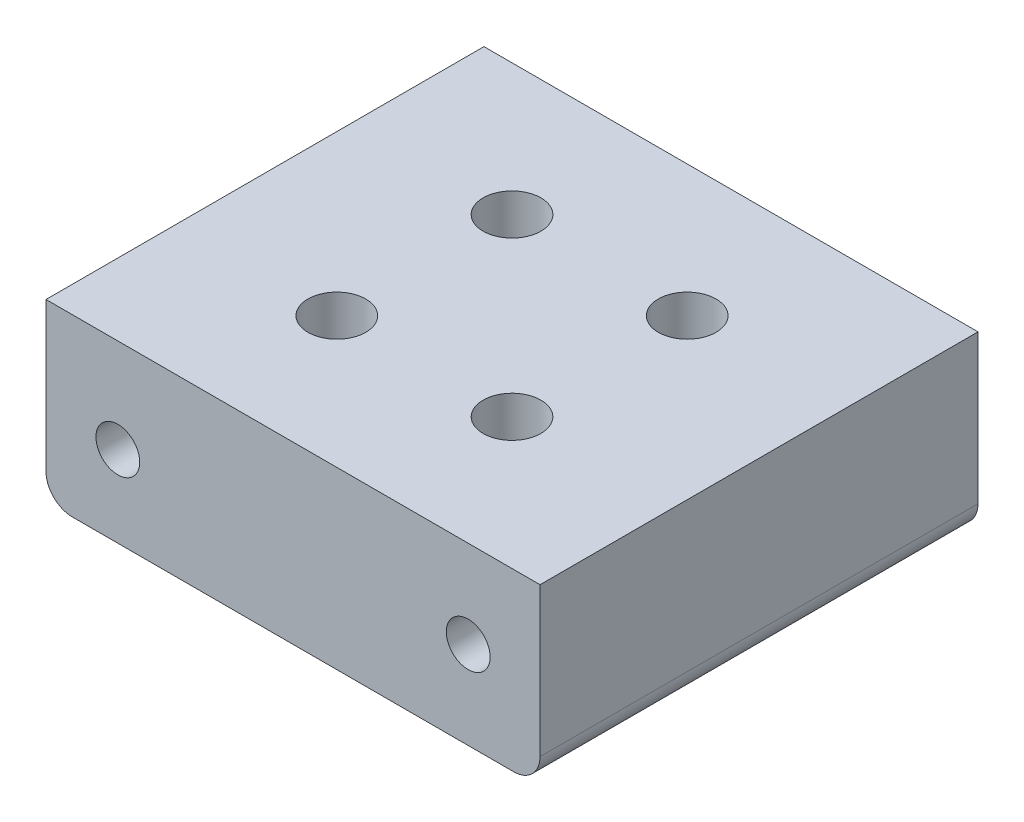
ISO-10303-21;
HEADER;
FILE_DESCRIPTION(('STEP AP214'),'2;1');
FILE_NAME('part.step','',(''),(''),'','','');
FILE_SCHEMA(('AUTOMOTIVE_DESIGN { 1 0 10303 214 1 1 1 1 }'));
ENDSEC;
DATA;
#1=APPLICATION_CONTEXT('core data for automotive mechanical design processes');
#2=APPLICATION_PROTOCOL_DEFINITION('international standard','automotive_design',2000,#1);
#3=PRODUCT_CONTEXT('',#1,'mechanical');
#4=PRODUCT('Part','Part','',(#3));
#5=PRODUCT_RELATED_PRODUCT_CATEGORY('part','',(#4));
#6=PRODUCT_DEFINITION_FORMATION('','',#4);
#7=PRODUCT_DEFINITION_CONTEXT('part definition',#1,'design');
#8=PRODUCT_DEFINITION('design','',#6,#7);
#9=PRODUCT_DEFINITION_SHAPE('','',#8);
#10=(LENGTH_UNIT() NAMED_UNIT(*) SI_UNIT(.MILLI.,.METRE.));
#11=(NAMED_UNIT(*) PLANE_ANGLE_UNIT() SI_UNIT($,.RADIAN.));
#12=(NAMED_UNIT(*) SI_UNIT($,.STERADIAN.) SOLID_ANGLE_UNIT());
#13=UNCERTAINTY_MEASURE_WITH_UNIT(LENGTH_MEASURE(1.E-05),#10,'distance_accuracy_value','');
#14=(GEOMETRIC_REPRESENTATION_CONTEXT(3) GLOBAL_UNCERTAINTY_ASSIGNED_CONTEXT((#13)) GLOBAL_UNIT_ASSIGNED_CONTEXT((#10,
#11,#12)) REPRESENTATION_CONTEXT('',''));
#15=CARTESIAN_POINT('',(0.,0.,0.));
#16=DIRECTION('',(0.,0.,1.));
#17=DIRECTION('',(1.,0.,0.));
#18=AXIS2_PLACEMENT_3D('',#15,#16,#17);
#19=CARTESIAN_POINT('',(-25.2000000001139,-34.4999999999999,0.));
#20=DIRECTION('',(0.,0.,1.));
#21=DIRECTION('',(1.,0.,0.));
#22=AXIS2_PLACEMENT_3D('',#19,#20,#21);
#23=PLANE('',#22);
#24=CARTESIAN_POINT('',(19.9999999998865,-27.4999999999999,0.));
#25=DIRECTION('',(0.,0.,-1.));
#26=DIRECTION('',(-1.,0.,0.));
#27=AXIS2_PLACEMENT_3D('',#24,#25,#26);
#28=CIRCLE('',#27,2.5);
#29=CARTESIAN_POINT('',(17.4999999998865,-27.4999999999999,0.));
#30=VERTEX_POINT('',#29);
#31=EDGE_CURVE('E216',#30,#30,#28,.T.);
#32=ORIENTED_EDGE('',*,*,#31,.F.);
#33=EDGE_LOOP('',(#32));
#34=FACE_BOUND('',#33,.T.);
#35=CARTESIAN_POINT('',(-25.2000000001139,-34.4999999999999,0.));
#36=DIRECTION('',(0.,0.,1.));
#37=DIRECTION('',(1.,0.,0.));
#38=AXIS2_PLACEMENT_3D('',#35,#36,#37);
#39=CIRCLE('',#38,3.);
#40=CARTESIAN_POINT('',(-28.2000000001139,-34.4999999999999,0.));
#41=VERTEX_POINT('',#40);
#42=CARTESIAN_POINT('',(-25.2000000001139,-37.4999999999999,0.));
#43=VERTEX_POINT('',#42);
#44=EDGE_CURVE('E118',#41,#43,#39,.T.);
#45=ORIENTED_EDGE('',*,*,#44,.F.);
#46=DIRECTION('',(0.,-1.,0.));
#47=VECTOR('',#46,1.);
#48=CARTESIAN_POINT('',(-28.2000000001139,-17.4999999999999,0.));
#49=LINE('',#48,#47);
#50=CARTESIAN_POINT('',(-28.2000000001139,-17.4999999999999,0.));
#51=VERTEX_POINT('',#50);
#52=EDGE_CURVE('E79',#51,#41,#49,.T.);
#53=ORIENTED_EDGE('',*,*,#52,.F.);
#54=DIRECTION('',(-1.,0.,0.));
#55=VECTOR('',#54,1.);
#56=CARTESIAN_POINT('',(28.1999999998861,-17.4999999999999,0.));
#57=LINE('',#56,#55);
#58=CARTESIAN_POINT('',(28.1999999998861,-17.4999999999999,0.));
#59=VERTEX_POINT('',#58);
#60=EDGE_CURVE('E73',#59,#51,#57,.T.);
#61=ORIENTED_EDGE('',*,*,#60,.F.);
#62=DIRECTION('',(0.,1.,0.));
#63=VECTOR('',#62,1.);
#64=CARTESIAN_POINT('',(28.1999999998861,-34.4999999999999,0.));
#65=LINE('',#64,#63);
#66=CARTESIAN_POINT('',(28.1999999998861,-34.4999999999999,0.));
#67=VERTEX_POINT('',#66);
#68=EDGE_CURVE('E108',#67,#59,#65,.T.);
#69=ORIENTED_EDGE('',*,*,#68,.F.);
#70=CARTESIAN_POINT('',(25.1999999998861,-34.4999999999999,0.));
#71=DIRECTION('',(0.,0.,1.));
#72=DIRECTION('',(1.,0.,0.));
#73=AXIS2_PLACEMENT_3D('',#70,#71,#72);
#74=CIRCLE('',#73,3.);
#75=CARTESIAN_POINT('',(25.1999999998861,-37.4999999999999,0.));
#76=VERTEX_POINT('',#75);
#77=EDGE_CURVE('E124',#76,#67,#74,.T.);
#78=ORIENTED_EDGE('',*,*,#77,.F.);
#79=DIRECTION('',(1.,0.,0.));
#80=VECTOR('',#79,1.);
#81=CARTESIAN_POINT('',(-25.2000000001139,-37.4999999999999,0.));
#82=LINE('',#81,#80);
#83=EDGE_CURVE('E121',#43,#76,#82,.T.);
#84=ORIENTED_EDGE('',*,*,#83,.F.);
#85=EDGE_LOOP('',(#45,#53,#61,#69,#78,#84));
#86=FACE_BOUND('',#85,.T.);
#87=CARTESIAN_POINT('',(-20.0000000001135,-28.2376577347049,0.));
#88=DIRECTION('',(0.,0.,-1.));
#89=DIRECTION('',(-1.,0.,0.));
#90=AXIS2_PLACEMENT_3D('',#87,#88,#89);
#91=CIRCLE('',#90,2.5);
#92=CARTESIAN_POINT('',(-22.5000000001135,-28.2376577347049,0.));
#93=VERTEX_POINT('',#92);
#94=EDGE_CURVE('E222',#93,#93,#91,.T.);
#95=ORIENTED_EDGE('',*,*,#94,.F.);
#96=EDGE_LOOP('',(#95));
#97=FACE_BOUND('',#96,.T.);
#98=ADVANCED_FACE('F33',(#34,#86,#97),#23,.F.);
#99=CARTESIAN_POINT('',(-25.2000000001139,-34.4999999999999,50.));
#100=DIRECTION('',(0.,0.,-1.));
#101=DIRECTION('',(-1.,0.,0.));
#102=AXIS2_PLACEMENT_3D('',#99,#100,#101);
#103=CYLINDRICAL_SURFACE('',#102,3.);
#104=ORIENTED_EDGE('',*,*,#44,.T.);
#105=DIRECTION('',(0.,0.,-1.));
#106=VECTOR('',#105,1.);
#107=CARTESIAN_POINT('',(-25.2000000001139,-37.4999999999999,50.));
#108=LINE('',#107,#106);
#109=CARTESIAN_POINT('',(-25.2000000001139,-37.4999999999999,50.));
#110=VERTEX_POINT('',#109);
#111=EDGE_CURVE('E11',#110,#43,#108,.T.);
#112=ORIENTED_EDGE('',*,*,#111,.F.);
#113=CARTESIAN_POINT('',(-25.2000000001139,-34.4999999999999,50.));
#114=DIRECTION('',(0.,0.,1.));
#115=DIRECTION('',(1.,0.,0.));
#116=AXIS2_PLACEMENT_3D('',#113,#114,#115);
#117=CIRCLE('',#116,3.);
#118=CARTESIAN_POINT('',(-28.2000000001139,-34.4999999999999,50.));
#119=VERTEX_POINT('',#118);
#120=EDGE_CURVE('E129',#119,#110,#117,.T.);
#121=ORIENTED_EDGE('',*,*,#120,.F.);
#122=DIRECTION('',(0.,0.,-1.));
#123=VECTOR('',#122,1.);
#124=CARTESIAN_POINT('',(-28.2000000001139,-34.4999999999999,50.));
#125=LINE('',#124,#123);
#126=EDGE_CURVE('E114',#119,#41,#125,.T.);
#127=ORIENTED_EDGE('',*,*,#126,.T.);
#128=EDGE_LOOP('',(#104,#112,#121,#127));
#129=FACE_BOUND('',#128,.T.);
#130=ADVANCED_FACE('F35',(#129),#103,.T.);
#131=CARTESIAN_POINT('',(-25.2000000001139,-37.4999999999999,50.));
#132=DIRECTION('',(0.,1.,0.));
#133=DIRECTION('',(0.,0.,1.));
#134=AXIS2_PLACEMENT_3D('',#131,#132,#133);
#135=PLANE('',#134);
#136=CARTESIAN_POINT('',(-10.0000000001784,-37.4999999999999,15.));
#137=DIRECTION('',(0.,-1.,0.));
#138=DIRECTION('',(0.,0.,-1.));
#139=AXIS2_PLACEMENT_3D('',#136,#137,#138);
#140=CIRCLE('',#139,3.3);
#141=CARTESIAN_POINT('',(-10.0000000001784,-37.4999999999999,11.7));
#142=VERTEX_POINT('',#141);
#143=EDGE_CURVE('E193',#142,#142,#140,.T.);
#144=ORIENTED_EDGE('',*,*,#143,.F.);
#145=EDGE_LOOP('',(#144));
#146=FACE_BOUND('',#145,.T.);
#147=CARTESIAN_POINT('',(9.99999999982159,-37.4999999999999,35.));
#148=DIRECTION('',(0.,-1.,0.));
#149=DIRECTION('',(0.,0.,-1.));
#150=AXIS2_PLACEMENT_3D('',#147,#148,#149);
#151=CIRCLE('',#150,3.3);
#152=CARTESIAN_POINT('',(9.99999999982159,-37.4999999999999,31.7));
#153=VERTEX_POINT('',#152);
#154=EDGE_CURVE('E196',#153,#153,#151,.T.);
#155=ORIENTED_EDGE('',*,*,#154,.F.);
#156=EDGE_LOOP('',(#155));
#157=FACE_BOUND('',#156,.T.);
#158=CARTESIAN_POINT('',(-10.0000000001784,-37.4999999999999,35.));
#159=DIRECTION('',(0.,-1.,0.));
#160=DIRECTION('',(0.,0.,-1.));
#161=AXIS2_PLACEMENT_3D('',#158,#159,#160);
#162=CIRCLE('',#161,3.3);
#163=CARTESIAN_POINT('',(-10.0000000001784,-37.4999999999999,31.7));
#164=VERTEX_POINT('',#163);
#165=EDGE_CURVE('E204',#164,#164,#162,.T.);
#166=ORIENTED_EDGE('',*,*,#165,.F.);
#167=EDGE_LOOP('',(#166));
#168=FACE_BOUND('',#167,.T.);
#169=CARTESIAN_POINT('',(9.99999999982159,-37.4999999999999,15.));
#170=DIRECTION('',(0.,-1.,0.));
#171=DIRECTION('',(0.,0.,-1.));
#172=AXIS2_PLACEMENT_3D('',#169,#170,#171);
#173=CIRCLE('',#172,3.3);
#174=CARTESIAN_POINT('',(9.99999999982159,-37.4999999999999,11.7));
#175=VERTEX_POINT('',#174);
#176=EDGE_CURVE('E210',#175,#175,#173,.T.);
#177=ORIENTED_EDGE('',*,*,#176,.F.);
#178=EDGE_LOOP('',(#177));
#179=FACE_BOUND('',#178,.T.);
#180=ORIENTED_EDGE('',*,*,#83,.T.);
#181=DIRECTION('',(0.,0.,-1.));
#182=VECTOR('',#181,1.);
#183=CARTESIAN_POINT('',(25.1999999998861,-37.4999999999999,50.));
#184=LINE('',#183,#182);
#185=CARTESIAN_POINT('',(25.1999999998861,-37.4999999999999,50.));
#186=VERTEX_POINT('',#185);
#187=EDGE_CURVE('E42',#186,#76,#184,.T.);
#188=ORIENTED_EDGE('',*,*,#187,.F.);
#189=DIRECTION('',(1.,0.,0.));
#190=VECTOR('',#189,1.);
#191=CARTESIAN_POINT('',(-25.2000000001139,-37.4999999999999,50.));
#192=LINE('',#191,#190);
#193=EDGE_CURVE('E87',#110,#186,#192,.T.);
#194=ORIENTED_EDGE('',*,*,#193,.F.);
#195=ORIENTED_EDGE('',*,*,#111,.T.);
#196=EDGE_LOOP('',(#180,#188,#194,#195));
#197=FACE_BOUND('',#196,.T.);
#198=ADVANCED_FACE('F160',(#146,#157,#168,#179,#197),#135,.F.);
#199=CARTESIAN_POINT('',(25.1999999998861,-34.4999999999999,50.));
#200=DIRECTION('',(0.,0.,-1.));
#201=DIRECTION('',(-1.,0.,0.));
#202=AXIS2_PLACEMENT_3D('',#199,#200,#201);
#203=CYLINDRICAL_SURFACE('',#202,3.);
#204=ORIENTED_EDGE('',*,*,#77,.T.);
#205=DIRECTION('',(0.,0.,-1.));
#206=VECTOR('',#205,1.);
#207=CARTESIAN_POINT('',(28.1999999998861,-34.4999999999999,50.));
#208=LINE('',#207,#206);
#209=CARTESIAN_POINT('',(28.1999999998861,-34.4999999999999,50.));
#210=VERTEX_POINT('',#209);
#211=EDGE_CURVE('E109',#210,#67,#208,.T.);
#212=ORIENTED_EDGE('',*,*,#211,.F.);
#213=CARTESIAN_POINT('',(25.1999999998861,-34.4999999999999,50.));
#214=DIRECTION('',(0.,0.,1.));
#215=DIRECTION('',(1.,0.,0.));
#216=AXIS2_PLACEMENT_3D('',#213,#214,#215);
#217=CIRCLE('',#216,3.);
#218=EDGE_CURVE('E100',#186,#210,#217,.T.);
#219=ORIENTED_EDGE('',*,*,#218,.F.);
#220=ORIENTED_EDGE('',*,*,#187,.T.);
#221=EDGE_LOOP('',(#204,#212,#219,#220));
#222=FACE_BOUND('',#221,.T.);
#223=ADVANCED_FACE('F135',(#222),#203,.T.);
#224=CARTESIAN_POINT('',(28.1999999998861,-34.4999999999999,50.));
#225=DIRECTION('',(-1.,0.,0.));
#226=DIRECTION('',(0.,0.,1.));
#227=AXIS2_PLACEMENT_3D('',#224,#225,#226);
#228=PLANE('',#227);
#229=ORIENTED_EDGE('',*,*,#68,.T.);
#230=DIRECTION('',(0.,0.,-1.));
#231=VECTOR('',#230,1.);
#232=CARTESIAN_POINT('',(28.1999999998861,-17.4999999999999,50.));
#233=LINE('',#232,#231);
#234=CARTESIAN_POINT('',(28.1999999998861,-17.4999999999999,50.));
#235=VERTEX_POINT('',#234);
#236=EDGE_CURVE('E105',#235,#59,#233,.T.);
#237=ORIENTED_EDGE('',*,*,#236,.F.);
#238=DIRECTION('',(0.,1.,0.));
#239=VECTOR('',#238,1.);
#240=CARTESIAN_POINT('',(28.1999999998861,-34.4999999999999,50.));
#241=LINE('',#240,#239);
#242=EDGE_CURVE('E94',#210,#235,#241,.T.);
#243=ORIENTED_EDGE('',*,*,#242,.F.);
#244=ORIENTED_EDGE('',*,*,#211,.T.);
#245=EDGE_LOOP('',(#229,#237,#243,#244));
#246=FACE_BOUND('',#245,.T.);
#247=ADVANCED_FACE('F106',(#246),#228,.F.);
#248=CARTESIAN_POINT('',(28.1999999998861,-17.4999999999999,50.));
#249=DIRECTION('',(0.,-1.,0.));
#250=DIRECTION('',(1.,0.,0.));
#251=AXIS2_PLACEMENT_3D('',#248,#249,#250);
#252=PLANE('',#251);
#253=CARTESIAN_POINT('',(-10.0000000001784,-17.4999999999999,15.));
#254=DIRECTION('',(0.,-1.,0.));
#255=DIRECTION('',(0.,0.,-1.));
#256=AXIS2_PLACEMENT_3D('',#253,#254,#255);
#257=CIRCLE('',#256,3.3);
#258=CARTESIAN_POINT('',(-10.0000000001784,-17.4999999999999,11.7));
#259=VERTEX_POINT('',#258);
#260=EDGE_CURVE('E190',#259,#259,#257,.T.);
#261=ORIENTED_EDGE('',*,*,#260,.T.);
#262=EDGE_LOOP('',(#261));
#263=FACE_BOUND('',#262,.T.);
#264=CARTESIAN_POINT('',(9.99999999982159,-17.4999999999999,35.));
#265=DIRECTION('',(0.,-1.,0.));
#266=DIRECTION('',(0.,0.,-1.));
#267=AXIS2_PLACEMENT_3D('',#264,#265,#266);
#268=CIRCLE('',#267,3.3);
#269=CARTESIAN_POINT('',(9.99999999982159,-17.4999999999999,31.7));
#270=VERTEX_POINT('',#269);
#271=EDGE_CURVE('E201',#270,#270,#268,.T.);
#272=ORIENTED_EDGE('',*,*,#271,.T.);
#273=EDGE_LOOP('',(#272));
#274=FACE_BOUND('',#273,.T.);
#275=CARTESIAN_POINT('',(-10.0000000001784,-17.4999999999999,35.));
#276=DIRECTION('',(0.,-1.,0.));
#277=DIRECTION('',(0.,0.,-1.));
#278=AXIS2_PLACEMENT_3D('',#275,#276,#277);
#279=CIRCLE('',#278,3.3);
#280=CARTESIAN_POINT('',(-10.0000000001784,-17.4999999999999,31.7));
#281=VERTEX_POINT('',#280);
#282=EDGE_CURVE('E207',#281,#281,#279,.T.);
#283=ORIENTED_EDGE('',*,*,#282,.T.);
#284=EDGE_LOOP('',(#283));
#285=FACE_BOUND('',#284,.T.);
#286=CARTESIAN_POINT('',(9.99999999982159,-17.4999999999999,15.));
#287=DIRECTION('',(0.,-1.,0.));
#288=DIRECTION('',(0.,0.,-1.));
#289=AXIS2_PLACEMENT_3D('',#286,#287,#288);
#290=CIRCLE('',#289,3.3);
#291=CARTESIAN_POINT('',(9.99999999982159,-17.4999999999999,11.7));
#292=VERTEX_POINT('',#291);
#293=EDGE_CURVE('E213',#292,#292,#290,.T.);
#294=ORIENTED_EDGE('',*,*,#293,.T.);
#295=EDGE_LOOP('',(#294));
#296=FACE_BOUND('',#295,.T.);
#297=ORIENTED_EDGE('',*,*,#60,.T.);
#298=DIRECTION('',(0.,0.,-1.));
#299=VECTOR('',#298,1.);
#300=CARTESIAN_POINT('',(-28.2000000001139,-17.4999999999999,50.));
#301=LINE('',#300,#299);
#302=CARTESIAN_POINT('',(-28.2000000001139,-17.4999999999999,50.));
#303=VERTEX_POINT('',#302);
#304=EDGE_CURVE('E110',#303,#51,#301,.T.);
#305=ORIENTED_EDGE('',*,*,#304,.F.);
#306=DIRECTION('',(-1.,0.,0.));
#307=VECTOR('',#306,1.);
#308=CARTESIAN_POINT('',(28.1999999998861,-17.4999999999999,50.));
#309=LINE('',#308,#307);
#310=EDGE_CURVE('E98',#235,#303,#309,.T.);
#311=ORIENTED_EDGE('',*,*,#310,.F.);
#312=ORIENTED_EDGE('',*,*,#236,.T.);
#313=EDGE_LOOP('',(#297,#305,#311,#312));
#314=FACE_BOUND('',#313,.T.);
#315=ADVANCED_FACE('F112',(#263,#274,#285,#296,#314),#252,.F.);
#316=CARTESIAN_POINT('',(-28.2000000001139,-17.4999999999999,50.));
#317=DIRECTION('',(1.,0.,0.));
#318=DIRECTION('',(0.,1.,0.));
#319=AXIS2_PLACEMENT_3D('',#316,#317,#318);
#320=PLANE('',#319);
#321=ORIENTED_EDGE('',*,*,#52,.T.);
#322=ORIENTED_EDGE('',*,*,#126,.F.);
#323=DIRECTION('',(0.,-1.,0.));
#324=VECTOR('',#323,1.);
#325=CARTESIAN_POINT('',(-28.2000000001139,-17.4999999999999,50.));
#326=LINE('',#325,#324);
#327=EDGE_CURVE('E50',#303,#119,#326,.T.);
#328=ORIENTED_EDGE('',*,*,#327,.F.);
#329=ORIENTED_EDGE('',*,*,#304,.T.);
#330=EDGE_LOOP('',(#321,#322,#328,#329));
#331=FACE_BOUND('',#330,.T.);
#332=ADVANCED_FACE('F142',(#331),#320,.F.);
#333=CARTESIAN_POINT('',(-25.2000000001139,-34.4999999999999,50.));
#334=DIRECTION('',(0.,0.,1.));
#335=DIRECTION('',(1.,0.,0.));
#336=AXIS2_PLACEMENT_3D('',#333,#334,#335);
#337=PLANE('',#336);
#338=CARTESIAN_POINT('',(19.9999999998865,-27.4999999999999,50.));
#339=DIRECTION('',(0.,0.,-1.));
#340=DIRECTION('',(-1.,0.,0.));
#341=AXIS2_PLACEMENT_3D('',#338,#339,#340);
#342=CIRCLE('',#341,2.49999999999999);
#343=CARTESIAN_POINT('',(17.4999999998865,-27.4999999999999,50.));
#344=VERTEX_POINT('',#343);
#345=EDGE_CURVE('E219',#344,#344,#342,.T.);
#346=ORIENTED_EDGE('',*,*,#345,.T.);
#347=EDGE_LOOP('',(#346));
#348=FACE_BOUND('',#347,.T.);
#349=CARTESIAN_POINT('',(-20.0000000001135,-28.2376577347049,50.));
#350=DIRECTION('',(0.,0.,-1.));
#351=DIRECTION('',(-1.,0.,0.));
#352=AXIS2_PLACEMENT_3D('',#349,#350,#351);
#353=CIRCLE('',#352,2.49999999999999);
#354=CARTESIAN_POINT('',(-22.5000000001135,-28.2376577347049,50.));
#355=VERTEX_POINT('',#354);
#356=EDGE_CURVE('E122',#355,#355,#353,.T.);
#357=ORIENTED_EDGE('',*,*,#356,.T.);
#358=EDGE_LOOP('',(#357));
#359=FACE_BOUND('',#358,.T.);
#360=ORIENTED_EDGE('',*,*,#120,.T.);
#361=ORIENTED_EDGE('',*,*,#193,.T.);
#362=ORIENTED_EDGE('',*,*,#218,.T.);
#363=ORIENTED_EDGE('',*,*,#242,.T.);
#364=ORIENTED_EDGE('',*,*,#310,.T.);
#365=ORIENTED_EDGE('',*,*,#327,.T.);
#366=EDGE_LOOP('',(#360,#361,#362,#363,#364,#365));
#367=FACE_BOUND('',#366,.T.);
#368=ADVANCED_FACE('F96',(#348,#359,#367),#337,.T.);
#369=CARTESIAN_POINT('',(-20.0000000001135,-28.2376577347049,0.));
#370=DIRECTION('',(0.,0.,-1.));
#371=DIRECTION('',(-1.,0.,0.));
#372=AXIS2_PLACEMENT_3D('',#369,#370,#371);
#373=CYLINDRICAL_SURFACE('',#372,2.5);
#374=ORIENTED_EDGE('',*,*,#356,.F.);
#375=EDGE_LOOP('',(#374));
#376=FACE_BOUND('',#375,.T.);
#377=ORIENTED_EDGE('',*,*,#94,.T.);
#378=EDGE_LOOP('',(#377));
#379=FACE_BOUND('',#378,.T.);
#380=ADVANCED_FACE('F149',(#376,#379),#373,.F.);
#381=CARTESIAN_POINT('',(19.9999999998865,-27.4999999999999,0.));
#382=DIRECTION('',(0.,0.,-1.));
#383=DIRECTION('',(-1.,0.,0.));
#384=AXIS2_PLACEMENT_3D('',#381,#382,#383);
#385=CYLINDRICAL_SURFACE('',#384,2.5);
#386=ORIENTED_EDGE('',*,*,#345,.F.);
#387=EDGE_LOOP('',(#386));
#388=FACE_BOUND('',#387,.T.);
#389=ORIENTED_EDGE('',*,*,#31,.T.);
#390=EDGE_LOOP('',(#389));
#391=FACE_BOUND('',#390,.T.);
#392=ADVANCED_FACE('F165',(#388,#391),#385,.F.);
#393=CARTESIAN_POINT('',(9.99999999982159,-37.4999999999999,15.));
#394=DIRECTION('',(0.,-1.,0.));
#395=DIRECTION('',(0.,0.,-1.));
#396=AXIS2_PLACEMENT_3D('',#393,#394,#395);
#397=CYLINDRICAL_SURFACE('',#396,3.3);
#398=ORIENTED_EDGE('',*,*,#293,.F.);
#399=EDGE_LOOP('',(#398));
#400=FACE_BOUND('',#399,.T.);
#401=ORIENTED_EDGE('',*,*,#176,.T.);
#402=EDGE_LOOP('',(#401));
#403=FACE_BOUND('',#402,.T.);
#404=ADVANCED_FACE('F169',(#400,#403),#397,.F.);
#405=CARTESIAN_POINT('',(-10.0000000001784,-37.4999999999999,35.));
#406=DIRECTION('',(0.,-1.,0.));
#407=DIRECTION('',(0.,0.,-1.));
#408=AXIS2_PLACEMENT_3D('',#405,#406,#407);
#409=CYLINDRICAL_SURFACE('',#408,3.3);
#410=ORIENTED_EDGE('',*,*,#282,.F.);
#411=EDGE_LOOP('',(#410));
#412=FACE_BOUND('',#411,.T.);
#413=ORIENTED_EDGE('',*,*,#165,.T.);
#414=EDGE_LOOP('',(#413));
#415=FACE_BOUND('',#414,.T.);
#416=ADVANCED_FACE('F173',(#412,#415),#409,.F.);
#417=CARTESIAN_POINT('',(9.99999999982159,-37.4999999999999,35.));
#418=DIRECTION('',(0.,-1.,0.));
#419=DIRECTION('',(0.,0.,-1.));
#420=AXIS2_PLACEMENT_3D('',#417,#418,#419);
#421=CYLINDRICAL_SURFACE('',#420,3.3);
#422=ORIENTED_EDGE('',*,*,#271,.F.);
#423=EDGE_LOOP('',(#422));
#424=FACE_BOUND('',#423,.T.);
#425=ORIENTED_EDGE('',*,*,#154,.T.);
#426=EDGE_LOOP('',(#425));
#427=FACE_BOUND('',#426,.T.);
#428=ADVANCED_FACE('F177',(#424,#427),#421,.F.);
#429=CARTESIAN_POINT('',(-10.0000000001784,-37.4999999999999,15.));
#430=DIRECTION('',(0.,-1.,0.));
#431=DIRECTION('',(0.,0.,-1.));
#432=AXIS2_PLACEMENT_3D('',#429,#430,#431);
#433=CYLINDRICAL_SURFACE('',#432,3.3);
#434=ORIENTED_EDGE('',*,*,#260,.F.);
#435=EDGE_LOOP('',(#434));
#436=FACE_BOUND('',#435,.T.);
#437=ORIENTED_EDGE('',*,*,#143,.T.);
#438=EDGE_LOOP('',(#437));
#439=FACE_BOUND('',#438,.T.);
#440=ADVANCED_FACE('F181',(#436,#439),#433,.F.);
#441=CLOSED_SHELL('',(#98,#130,#198,#223,#247,#315,#332,#368,#380,#392,#404,#416,#428,#440));
#442=MANIFOLD_SOLID_BREP('B2',#441);
#443=ADVANCED_BREP_SHAPE_REPRESENTATION('',(#18,#442),#14);
#444=SHAPE_DEFINITION_REPRESENTATION(#9,#443);
ENDSEC;
END-ISO-10303-21;
